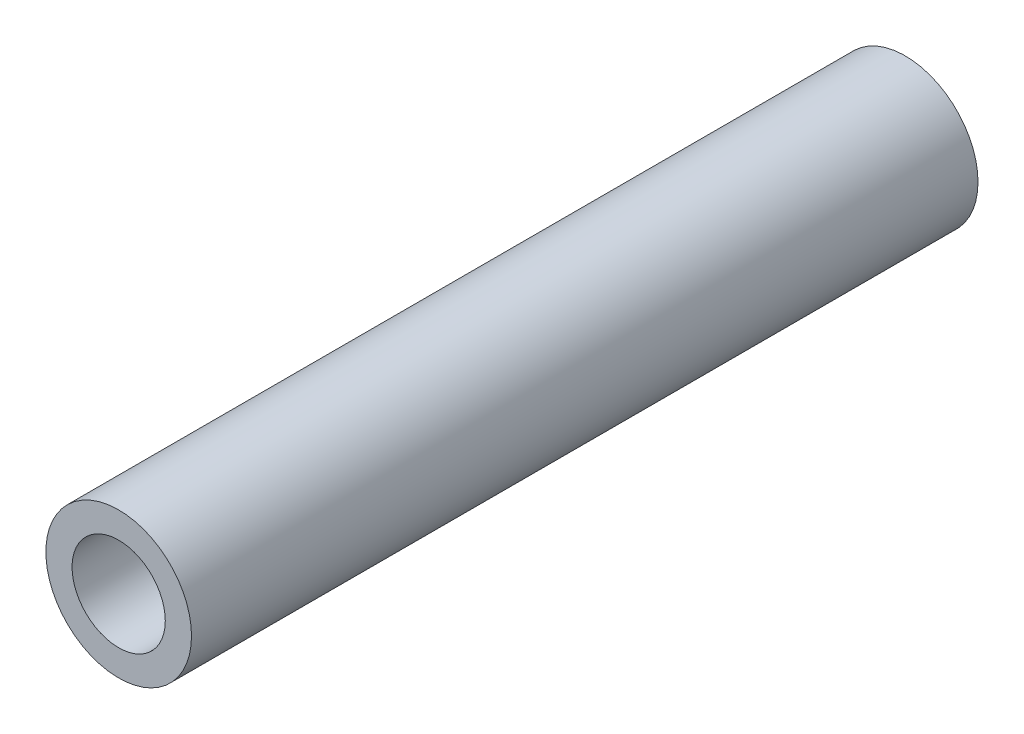
ISO-10303-21;
HEADER;
FILE_DESCRIPTION(('STEP AP214'),'2;1');
FILE_NAME('part.step','',(''),(''),'','','');
FILE_SCHEMA(('AUTOMOTIVE_DESIGN { 1 0 10303 214 1 1 1 1 }'));
ENDSEC;
DATA;
#1=APPLICATION_CONTEXT('core data for automotive mechanical design processes');
#2=APPLICATION_PROTOCOL_DEFINITION('international standard','automotive_design',2000,#1);
#3=PRODUCT_CONTEXT('',#1,'mechanical');
#4=PRODUCT('Part','Part','',(#3));
#5=PRODUCT_RELATED_PRODUCT_CATEGORY('part','',(#4));
#6=PRODUCT_DEFINITION_FORMATION('','',#4);
#7=PRODUCT_DEFINITION_CONTEXT('part definition',#1,'design');
#8=PRODUCT_DEFINITION('design','',#6,#7);
#9=PRODUCT_DEFINITION_SHAPE('','',#8);
#10=(LENGTH_UNIT() NAMED_UNIT(*) SI_UNIT(.MILLI.,.METRE.));
#11=(NAMED_UNIT(*) PLANE_ANGLE_UNIT() SI_UNIT($,.RADIAN.));
#12=(NAMED_UNIT(*) SI_UNIT($,.STERADIAN.) SOLID_ANGLE_UNIT());
#13=UNCERTAINTY_MEASURE_WITH_UNIT(LENGTH_MEASURE(1.E-05),#10,'distance_accuracy_value','');
#14=(GEOMETRIC_REPRESENTATION_CONTEXT(3) GLOBAL_UNCERTAINTY_ASSIGNED_CONTEXT((#13)) GLOBAL_UNIT_ASSIGNED_CONTEXT((#10,
#11,#12)) REPRESENTATION_CONTEXT('',''));
#15=CARTESIAN_POINT('',(0.,0.,0.));
#16=DIRECTION('',(0.,0.,1.));
#17=DIRECTION('',(1.,0.,0.));
#18=AXIS2_PLACEMENT_3D('',#15,#16,#17);
#19=CARTESIAN_POINT('',(0.,0.,27.));
#20=DIRECTION('',(0.,0.,1.));
#21=DIRECTION('',(1.,0.,0.));
#22=AXIS2_PLACEMENT_3D('',#19,#20,#21);
#23=PLANE('',#22);
#24=CARTESIAN_POINT('',(0.,0.,27.));
#25=DIRECTION('',(0.,0.,1.));
#26=DIRECTION('',(1.,0.,0.));
#27=AXIS2_PLACEMENT_3D('',#24,#25,#26);
#28=CIRCLE('',#27,2.5);
#29=CARTESIAN_POINT('',(2.5,0.,27.));
#30=VERTEX_POINT('',#29);
#31=EDGE_CURVE('E10',#30,#30,#28,.T.);
#32=ORIENTED_EDGE('',*,*,#31,.T.);
#33=EDGE_LOOP('',(#32));
#34=FACE_BOUND('',#33,.T.);
#35=CARTESIAN_POINT('',(0.,0.,27.));
#36=DIRECTION('',(0.,0.,1.));
#37=DIRECTION('',(1.,0.,0.));
#38=AXIS2_PLACEMENT_3D('',#35,#36,#37);
#39=CIRCLE('',#38,1.6);
#40=CARTESIAN_POINT('',(1.6,0.,27.));
#41=VERTEX_POINT('',#40);
#42=EDGE_CURVE('E42',#41,#41,#39,.T.);
#43=ORIENTED_EDGE('',*,*,#42,.F.);
#44=EDGE_LOOP('',(#43));
#45=FACE_BOUND('',#44,.T.);
#46=ADVANCED_FACE('F31',(#34,#45),#23,.T.);
#47=CARTESIAN_POINT('',(0.,0.,0.));
#48=DIRECTION('',(0.,0.,1.));
#49=DIRECTION('',(1.,0.,0.));
#50=AXIS2_PLACEMENT_3D('',#47,#48,#49);
#51=PLANE('',#50);
#52=CARTESIAN_POINT('',(0.,0.,0.));
#53=DIRECTION('',(0.,0.,1.));
#54=DIRECTION('',(1.,0.,0.));
#55=AXIS2_PLACEMENT_3D('',#52,#53,#54);
#56=CIRCLE('',#55,2.5);
#57=CARTESIAN_POINT('',(2.5,0.,0.));
#58=VERTEX_POINT('',#57);
#59=EDGE_CURVE('E35',#58,#58,#56,.T.);
#60=ORIENTED_EDGE('',*,*,#59,.F.);
#61=EDGE_LOOP('',(#60));
#62=FACE_BOUND('',#61,.T.);
#63=CARTESIAN_POINT('',(0.,0.,0.));
#64=DIRECTION('',(0.,0.,1.));
#65=DIRECTION('',(1.,0.,0.));
#66=AXIS2_PLACEMENT_3D('',#63,#64,#65);
#67=CIRCLE('',#66,1.6);
#68=CARTESIAN_POINT('',(1.6,0.,0.));
#69=VERTEX_POINT('',#68);
#70=EDGE_CURVE('E44',#69,#69,#67,.T.);
#71=ORIENTED_EDGE('',*,*,#70,.T.);
#72=EDGE_LOOP('',(#71));
#73=FACE_BOUND('',#72,.T.);
#74=ADVANCED_FACE('F54',(#62,#73),#51,.F.);
#75=CARTESIAN_POINT('',(0.,0.,27.));
#76=DIRECTION('',(0.,0.,-1.));
#77=DIRECTION('',(-1.,0.,0.));
#78=AXIS2_PLACEMENT_3D('',#75,#76,#77);
#79=CYLINDRICAL_SURFACE('',#78,2.5);
#80=ORIENTED_EDGE('',*,*,#31,.F.);
#81=EDGE_LOOP('',(#80));
#82=FACE_BOUND('',#81,.T.);
#83=ORIENTED_EDGE('',*,*,#59,.T.);
#84=EDGE_LOOP('',(#83));
#85=FACE_BOUND('',#84,.T.);
#86=ADVANCED_FACE('F33',(#82,#85),#79,.T.);
#87=CARTESIAN_POINT('',(0.,0.,27.));
#88=DIRECTION('',(0.,0.,-1.));
#89=DIRECTION('',(-1.,0.,0.));
#90=AXIS2_PLACEMENT_3D('',#87,#88,#89);
#91=CYLINDRICAL_SURFACE('',#90,1.6);
#92=ORIENTED_EDGE('',*,*,#42,.T.);
#93=EDGE_LOOP('',(#92));
#94=FACE_BOUND('',#93,.T.);
#95=ORIENTED_EDGE('',*,*,#70,.F.);
#96=EDGE_LOOP('',(#95));
#97=FACE_BOUND('',#96,.T.);
#98=ADVANCED_FACE('F50',(#94,#97),#91,.F.);
#99=CLOSED_SHELL('',(#46,#74,#86,#98));
#100=MANIFOLD_SOLID_BREP('B2',#99);
#101=ADVANCED_BREP_SHAPE_REPRESENTATION('',(#18,#100),#14);
#102=SHAPE_DEFINITION_REPRESENTATION(#9,#101);
ENDSEC;
END-ISO-10303-21;
